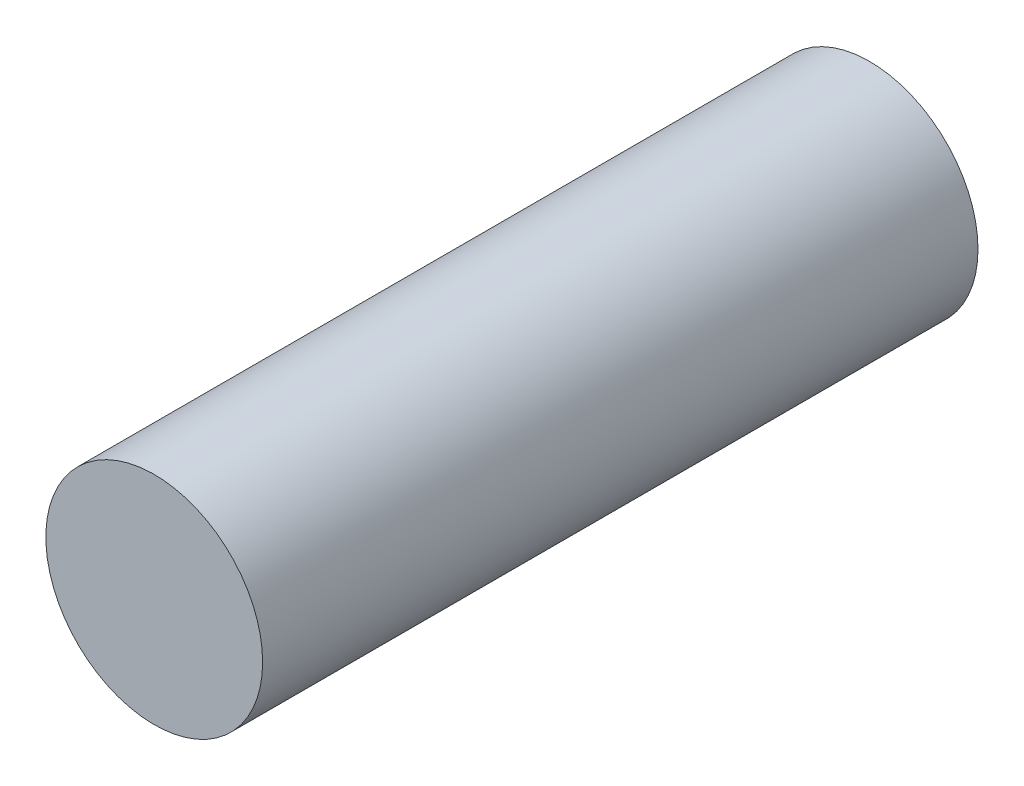
ISO-10303-21;
HEADER;
FILE_DESCRIPTION(('STEP AP214'),'2;1');
FILE_NAME('part.step','',(''),(''),'','','');
FILE_SCHEMA(('AUTOMOTIVE_DESIGN { 1 0 10303 214 1 1 1 1 }'));
ENDSEC;
DATA;
#1=APPLICATION_CONTEXT('core data for automotive mechanical design processes');
#2=APPLICATION_PROTOCOL_DEFINITION('international standard','automotive_design',2000,#1);
#3=PRODUCT_CONTEXT('',#1,'mechanical');
#4=PRODUCT('Part','Part','',(#3));
#5=PRODUCT_RELATED_PRODUCT_CATEGORY('part','',(#4));
#6=PRODUCT_DEFINITION_FORMATION('','',#4);
#7=PRODUCT_DEFINITION_CONTEXT('part definition',#1,'design');
#8=PRODUCT_DEFINITION('design','',#6,#7);
#9=PRODUCT_DEFINITION_SHAPE('','',#8);
#10=(LENGTH_UNIT() NAMED_UNIT(*) SI_UNIT(.MILLI.,.METRE.));
#11=(NAMED_UNIT(*) PLANE_ANGLE_UNIT() SI_UNIT($,.RADIAN.));
#12=(NAMED_UNIT(*) SI_UNIT($,.STERADIAN.) SOLID_ANGLE_UNIT());
#13=UNCERTAINTY_MEASURE_WITH_UNIT(LENGTH_MEASURE(1.E-05),#10,'distance_accuracy_value','');
#14=(GEOMETRIC_REPRESENTATION_CONTEXT(3) GLOBAL_UNCERTAINTY_ASSIGNED_CONTEXT((#13)) GLOBAL_UNIT_ASSIGNED_CONTEXT((#10,
#11,#12)) REPRESENTATION_CONTEXT('',''));
#15=CARTESIAN_POINT('',(0.,0.,0.));
#16=DIRECTION('',(0.,0.,1.));
#17=DIRECTION('',(1.,0.,0.));
#18=AXIS2_PLACEMENT_3D('',#15,#16,#17);
#19=CARTESIAN_POINT('',(0.,0.,41.91));
#20=DIRECTION('',(0.,0.,-1.));
#21=DIRECTION('',(-1.,0.,0.));
#22=AXIS2_PLACEMENT_3D('',#19,#20,#21);
#23=CYLINDRICAL_SURFACE('',#22,6.35);
#24=CARTESIAN_POINT('',(0.,0.,41.91));
#25=DIRECTION('',(0.,0.,1.));
#26=DIRECTION('',(1.,0.,0.));
#27=AXIS2_PLACEMENT_3D('',#24,#25,#26);
#28=CIRCLE('',#27,6.35);
#29=CARTESIAN_POINT('',(6.35,0.,41.91));
#30=VERTEX_POINT('',#29);
#31=EDGE_CURVE('E10',#30,#30,#28,.T.);
#32=ORIENTED_EDGE('',*,*,#31,.F.);
#33=EDGE_LOOP('',(#32));
#34=FACE_BOUND('',#33,.T.);
#35=CARTESIAN_POINT('',(0.,0.,0.));
#36=DIRECTION('',(0.,0.,1.));
#37=DIRECTION('',(1.,0.,0.));
#38=AXIS2_PLACEMENT_3D('',#35,#36,#37);
#39=CIRCLE('',#38,6.35);
#40=CARTESIAN_POINT('',(6.35,0.,0.));
#41=VERTEX_POINT('',#40);
#42=EDGE_CURVE('E33',#41,#41,#39,.T.);
#43=ORIENTED_EDGE('',*,*,#42,.T.);
#44=EDGE_LOOP('',(#43));
#45=FACE_BOUND('',#44,.T.);
#46=ADVANCED_FACE('F30',(#34,#45),#23,.T.);
#47=CARTESIAN_POINT('',(0.,0.,41.91));
#48=DIRECTION('',(0.,0.,1.));
#49=DIRECTION('',(1.,0.,0.));
#50=AXIS2_PLACEMENT_3D('',#47,#48,#49);
#51=PLANE('',#50);
#52=ORIENTED_EDGE('',*,*,#31,.T.);
#53=EDGE_LOOP('',(#52));
#54=FACE_BOUND('',#53,.T.);
#55=ADVANCED_FACE('F45',(#54),#51,.T.);
#56=CARTESIAN_POINT('',(0.,0.,0.));
#57=DIRECTION('',(0.,0.,1.));
#58=DIRECTION('',(1.,0.,0.));
#59=AXIS2_PLACEMENT_3D('',#56,#57,#58);
#60=PLANE('',#59);
#61=ORIENTED_EDGE('',*,*,#42,.F.);
#62=EDGE_LOOP('',(#61));
#63=FACE_BOUND('',#62,.T.);
#64=ADVANCED_FACE('F43',(#63),#60,.F.);
#65=CLOSED_SHELL('',(#46,#55,#64));
#66=MANIFOLD_SOLID_BREP('B2',#65);
#67=ADVANCED_BREP_SHAPE_REPRESENTATION('',(#18,#66),#14);
#68=SHAPE_DEFINITION_REPRESENTATION(#9,#67);
ENDSEC;
END-ISO-10303-21;
